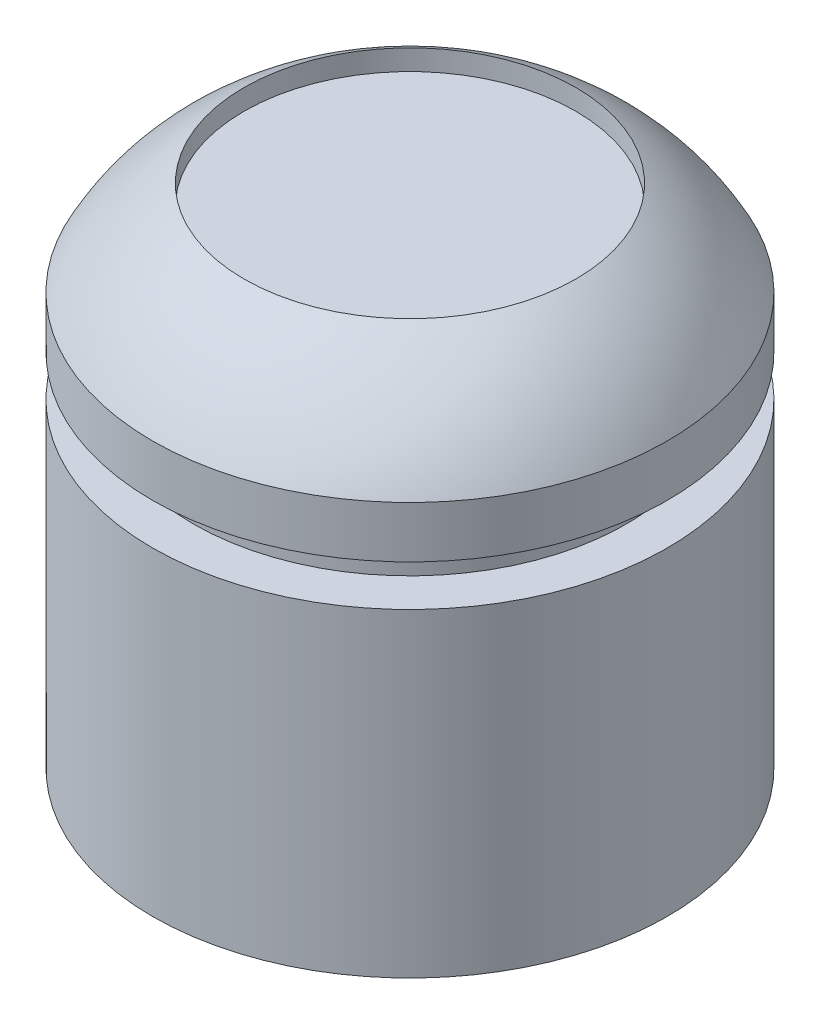
ISO-10303-21;
HEADER;
FILE_DESCRIPTION(('STEP AP214'),'2;1');
FILE_NAME('part.step','',(''),(''),'','','');
FILE_SCHEMA(('AUTOMOTIVE_DESIGN { 1 0 10303 214 1 1 1 1 }'));
ENDSEC;
DATA;
#1=APPLICATION_CONTEXT('core data for automotive mechanical design processes');
#2=APPLICATION_PROTOCOL_DEFINITION('international standard','automotive_design',2000,#1);
#3=PRODUCT_CONTEXT('',#1,'mechanical');
#4=PRODUCT('Part','Part','',(#3));
#5=PRODUCT_RELATED_PRODUCT_CATEGORY('part','',(#4));
#6=PRODUCT_DEFINITION_FORMATION('','',#4);
#7=PRODUCT_DEFINITION_CONTEXT('part definition',#1,'design');
#8=PRODUCT_DEFINITION('design','',#6,#7);
#9=PRODUCT_DEFINITION_SHAPE('','',#8);
#10=(LENGTH_UNIT() NAMED_UNIT(*) SI_UNIT(.MILLI.,.METRE.));
#11=(NAMED_UNIT(*) PLANE_ANGLE_UNIT() SI_UNIT($,.RADIAN.));
#12=(NAMED_UNIT(*) SI_UNIT($,.STERADIAN.) SOLID_ANGLE_UNIT());
#13=UNCERTAINTY_MEASURE_WITH_UNIT(LENGTH_MEASURE(1.E-05),#10,'distance_accuracy_value','');
#14=(GEOMETRIC_REPRESENTATION_CONTEXT(3) GLOBAL_UNCERTAINTY_ASSIGNED_CONTEXT((#13)) GLOBAL_UNIT_ASSIGNED_CONTEXT((#10,
#11,#12)) REPRESENTATION_CONTEXT('',''));
#15=CARTESIAN_POINT('',(0.,0.,0.));
#16=DIRECTION('',(0.,0.,1.));
#17=DIRECTION('',(1.,0.,0.));
#18=AXIS2_PLACEMENT_3D('',#15,#16,#17);
#19=CARTESIAN_POINT('',(0.,0.,0.));
#20=DIRECTION('',(0.,-1.,0.));
#21=DIRECTION('',(0.,0.,-1.));
#22=AXIS2_PLACEMENT_3D('',#19,#20,#21);
#23=PLANE('',#22);
#24=CARTESIAN_POINT('',(0.,0.,-12.5));
#25=DIRECTION('',(0.,-1.,0.));
#26=DIRECTION('',(0.,0.,-1.));
#27=AXIS2_PLACEMENT_3D('',#24,#25,#26);
#28=CIRCLE('',#27,1.5);
#29=CARTESIAN_POINT('',(0.,0.,-14.));
#30=VERTEX_POINT('',#29);
#31=EDGE_CURVE('E62',#30,#30,#28,.T.);
#32=ORIENTED_EDGE('',*,*,#31,.F.);
#33=EDGE_LOOP('',(#32));
#34=FACE_BOUND('',#33,.T.);
#35=CARTESIAN_POINT('',(0.,0.,-12.5));
#36=DIRECTION('',(0.,1.,0.));
#37=DIRECTION('',(0.,0.,1.));
#38=AXIS2_PLACEMENT_3D('',#35,#36,#37);
#39=CIRCLE('',#38,12.5);
#40=CARTESIAN_POINT('',(0.,0.,0.));
#41=VERTEX_POINT('',#40);
#42=EDGE_CURVE('E54',#41,#41,#39,.T.);
#43=ORIENTED_EDGE('',*,*,#42,.F.);
#44=EDGE_LOOP('',(#43));
#45=FACE_BOUND('',#44,.T.);
#46=ADVANCED_FACE('F32',(#34,#45),#23,.T.);
#47=CARTESIAN_POINT('',(0.,24.5882164707435,-4.44285741524164));
#48=CARTESIAN_POINT('',(0.,22.9612180589206,-1.55614140381299));
#49=CARTESIAN_POINT('',(0.,20.,0.));
#50=B_SPLINE_CURVE_WITH_KNOTS('',2,(#47,#48,#49),.UNSPECIFIED.,.F.,.F.,(3,3),(0.,1.),.UNSPECIFIED.);
#51=CARTESIAN_POINT('',(0.,24.5882164707435,-12.5));
#52=DIRECTION('',(0.,1.,0.));
#53=AXIS1_PLACEMENT('',#51,#52);
#54=SURFACE_OF_REVOLUTION('',#50,#53);
#55=CARTESIAN_POINT('',(0.,20.,-12.5));
#56=DIRECTION('',(0.,1.,0.));
#57=DIRECTION('',(0.,0.,1.));
#58=AXIS2_PLACEMENT_3D('',#55,#56,#57);
#59=CIRCLE('',#58,12.5);
#60=CARTESIAN_POINT('',(0.,20.,0.));
#61=VERTEX_POINT('',#60);
#62=EDGE_CURVE('E10',#61,#61,#59,.T.);
#63=ORIENTED_EDGE('',*,*,#62,.T.);
#64=EDGE_LOOP('',(#63));
#65=FACE_BOUND('',#64,.T.);
#66=CARTESIAN_POINT('',(0.,24.5882164707435,-12.5));
#67=DIRECTION('',(0.,1.,0.));
#68=DIRECTION('',(0.,0.,1.));
#69=AXIS2_PLACEMENT_3D('',#66,#67,#68);
#70=CIRCLE('',#69,8.05714258475836);
#71=CARTESIAN_POINT('',(0.,24.5882164707435,-4.44285741524164));
#72=VERTEX_POINT('',#71);
#73=EDGE_CURVE('E125',#72,#72,#70,.T.);
#74=ORIENTED_EDGE('',*,*,#73,.F.);
#75=EDGE_LOOP('',(#74));
#76=FACE_BOUND('',#75,.T.);
#77=ADVANCED_FACE('F67',(#65,#76),#54,.F.);
#78=CARTESIAN_POINT('',(0.,24.5882164707435,-12.5));
#79=DIRECTION('',(0.,1.,0.));
#80=DIRECTION('',(0.,0.,1.));
#81=AXIS2_PLACEMENT_3D('',#78,#79,#80);
#82=CYLINDRICAL_SURFACE('',#81,12.5);
#83=CARTESIAN_POINT('',(0.,17.5,-12.5));
#84=DIRECTION('',(0.,1.,0.));
#85=DIRECTION('',(0.,0.,1.));
#86=AXIS2_PLACEMENT_3D('',#83,#84,#85);
#87=CIRCLE('',#86,12.5);
#88=CARTESIAN_POINT('',(0.,17.5,0.));
#89=VERTEX_POINT('',#88);
#90=EDGE_CURVE('E38',#89,#89,#87,.T.);
#91=ORIENTED_EDGE('',*,*,#90,.T.);
#92=EDGE_LOOP('',(#91));
#93=FACE_BOUND('',#92,.T.);
#94=ORIENTED_EDGE('',*,*,#62,.F.);
#95=EDGE_LOOP('',(#94));
#96=FACE_BOUND('',#95,.T.);
#97=ADVANCED_FACE('F70',(#93,#96),#82,.T.);
#98=CARTESIAN_POINT('',(0.,17.5,0.));
#99=DIRECTION('',(0.,-1.,0.));
#100=DIRECTION('',(0.,0.,-1.));
#101=AXIS2_PLACEMENT_3D('',#98,#99,#100);
#102=PLANE('',#101);
#103=CARTESIAN_POINT('',(0.,17.5,-12.5));
#104=DIRECTION('',(0.,1.,0.));
#105=DIRECTION('',(0.,0.,1.));
#106=AXIS2_PLACEMENT_3D('',#103,#104,#105);
#107=CIRCLE('',#106,10.5);
#108=CARTESIAN_POINT('',(0.,17.5,-2.));
#109=VERTEX_POINT('',#108);
#110=EDGE_CURVE('E42',#109,#109,#107,.T.);
#111=ORIENTED_EDGE('',*,*,#110,.T.);
#112=EDGE_LOOP('',(#111));
#113=FACE_BOUND('',#112,.T.);
#114=ORIENTED_EDGE('',*,*,#90,.F.);
#115=EDGE_LOOP('',(#114));
#116=FACE_BOUND('',#115,.T.);
#117=ADVANCED_FACE('F73',(#113,#116),#102,.T.);
#118=CARTESIAN_POINT('',(0.,24.5882164707435,-12.5));
#119=DIRECTION('',(0.,1.,0.));
#120=DIRECTION('',(0.,0.,1.));
#121=AXIS2_PLACEMENT_3D('',#118,#119,#120);
#122=CYLINDRICAL_SURFACE('',#121,10.5);
#123=CARTESIAN_POINT('',(0.,15.5,-12.5));
#124=DIRECTION('',(0.,1.,0.));
#125=DIRECTION('',(0.,0.,1.));
#126=AXIS2_PLACEMENT_3D('',#123,#124,#125);
#127=CIRCLE('',#126,10.5);
#128=CARTESIAN_POINT('',(0.,15.5,-2.));
#129=VERTEX_POINT('',#128);
#130=EDGE_CURVE('E46',#129,#129,#127,.T.);
#131=ORIENTED_EDGE('',*,*,#130,.T.);
#132=EDGE_LOOP('',(#131));
#133=FACE_BOUND('',#132,.T.);
#134=ORIENTED_EDGE('',*,*,#110,.F.);
#135=EDGE_LOOP('',(#134));
#136=FACE_BOUND('',#135,.T.);
#137=ADVANCED_FACE('F76',(#133,#136),#122,.T.);
#138=CARTESIAN_POINT('',(0.,15.5,-2.));
#139=DIRECTION('',(0.,1.,0.));
#140=DIRECTION('',(0.,0.,1.));
#141=AXIS2_PLACEMENT_3D('',#138,#139,#140);
#142=PLANE('',#141);
#143=CARTESIAN_POINT('',(0.,15.5,-12.5));
#144=DIRECTION('',(0.,1.,0.));
#145=DIRECTION('',(0.,0.,1.));
#146=AXIS2_PLACEMENT_3D('',#143,#144,#145);
#147=CIRCLE('',#146,12.5);
#148=CARTESIAN_POINT('',(0.,15.5,0.));
#149=VERTEX_POINT('',#148);
#150=EDGE_CURVE('E51',#149,#149,#147,.T.);
#151=ORIENTED_EDGE('',*,*,#150,.T.);
#152=EDGE_LOOP('',(#151));
#153=FACE_BOUND('',#152,.T.);
#154=ORIENTED_EDGE('',*,*,#130,.F.);
#155=EDGE_LOOP('',(#154));
#156=FACE_BOUND('',#155,.T.);
#157=ADVANCED_FACE('F80',(#153,#156),#142,.T.);
#158=CARTESIAN_POINT('',(0.,24.5882164707435,-12.5));
#159=DIRECTION('',(0.,1.,0.));
#160=DIRECTION('',(0.,0.,1.));
#161=AXIS2_PLACEMENT_3D('',#158,#159,#160);
#162=CYLINDRICAL_SURFACE('',#161,12.5);
#163=ORIENTED_EDGE('',*,*,#42,.T.);
#164=EDGE_LOOP('',(#163));
#165=FACE_BOUND('',#164,.T.);
#166=ORIENTED_EDGE('',*,*,#150,.F.);
#167=EDGE_LOOP('',(#166));
#168=FACE_BOUND('',#167,.T.);
#169=ADVANCED_FACE('F84',(#165,#168),#162,.T.);
#170=CARTESIAN_POINT('',(0.,4.,-12.5));
#171=DIRECTION('',(0.,-1.,0.));
#172=DIRECTION('',(0.,0.,-1.));
#173=AXIS2_PLACEMENT_3D('',#170,#171,#172);
#174=CYLINDRICAL_SURFACE('',#173,1.5);
#175=CARTESIAN_POINT('',(0.,4.,-12.5));
#176=DIRECTION('',(0.,-1.,0.));
#177=DIRECTION('',(0.,0.,-1.));
#178=AXIS2_PLACEMENT_3D('',#175,#176,#177);
#179=CIRCLE('',#178,1.5);
#180=CARTESIAN_POINT('',(0.,4.,-14.));
#181=VERTEX_POINT('',#180);
#182=EDGE_CURVE('E57',#181,#181,#179,.T.);
#183=ORIENTED_EDGE('',*,*,#182,.F.);
#184=EDGE_LOOP('',(#183));
#185=FACE_BOUND('',#184,.T.);
#186=ORIENTED_EDGE('',*,*,#31,.T.);
#187=EDGE_LOOP('',(#186));
#188=FACE_BOUND('',#187,.T.);
#189=ADVANCED_FACE('F88',(#185,#188),#174,.F.);
#190=CARTESIAN_POINT('',(0.,4.,-12.5));
#191=DIRECTION('',(0.,-1.,0.));
#192=DIRECTION('',(0.,0.,-1.));
#193=AXIS2_PLACEMENT_3D('',#190,#191,#192);
#194=PLANE('',#193);
#195=ORIENTED_EDGE('',*,*,#182,.T.);
#196=EDGE_LOOP('',(#195));
#197=FACE_BOUND('',#196,.T.);
#198=ADVANCED_FACE('F92',(#197),#194,.T.);
#199=CARTESIAN_POINT('',(0.,23.5882164707435,-12.5));
#200=DIRECTION('',(0.,1.,0.));
#201=DIRECTION('',(0.,0.,1.));
#202=AXIS2_PLACEMENT_3D('',#199,#200,#201);
#203=CYLINDRICAL_SURFACE('',#202,8.05714258475836);
#204=CARTESIAN_POINT('',(0.,23.5882164707435,-12.5));
#205=DIRECTION('',(0.,1.,0.));
#206=DIRECTION('',(0.,0.,1.));
#207=AXIS2_PLACEMENT_3D('',#204,#205,#206);
#208=CIRCLE('',#207,8.05714258475836);
#209=CARTESIAN_POINT('',(0.,23.5882164707435,-4.44285741524164));
#210=VERTEX_POINT('',#209);
#211=EDGE_CURVE('E123',#210,#210,#208,.T.);
#212=ORIENTED_EDGE('',*,*,#211,.F.);
#213=EDGE_LOOP('',(#212));
#214=FACE_BOUND('',#213,.T.);
#215=ORIENTED_EDGE('',*,*,#73,.T.);
#216=EDGE_LOOP('',(#215));
#217=FACE_BOUND('',#216,.T.);
#218=ADVANCED_FACE('F96',(#214,#217),#203,.F.);
#219=CARTESIAN_POINT('',(0.,23.5882164707435,-12.5));
#220=DIRECTION('',(0.,1.,0.));
#221=DIRECTION('',(0.,0.,1.));
#222=AXIS2_PLACEMENT_3D('',#219,#220,#221);
#223=PLANE('',#222);
#224=ORIENTED_EDGE('',*,*,#211,.T.);
#225=EDGE_LOOP('',(#224));
#226=FACE_BOUND('',#225,.T.);
#227=ADVANCED_FACE('F100',(#226),#223,.T.);
#228=CLOSED_SHELL('',(#46,#77,#97,#117,#137,#157,#169,#189,#198,#218,#227));
#229=MANIFOLD_SOLID_BREP('B2',#228);
#230=ADVANCED_BREP_SHAPE_REPRESENTATION('',(#18,#229),#14);
#231=SHAPE_DEFINITION_REPRESENTATION(#9,#230);
ENDSEC;
END-ISO-10303-21;
